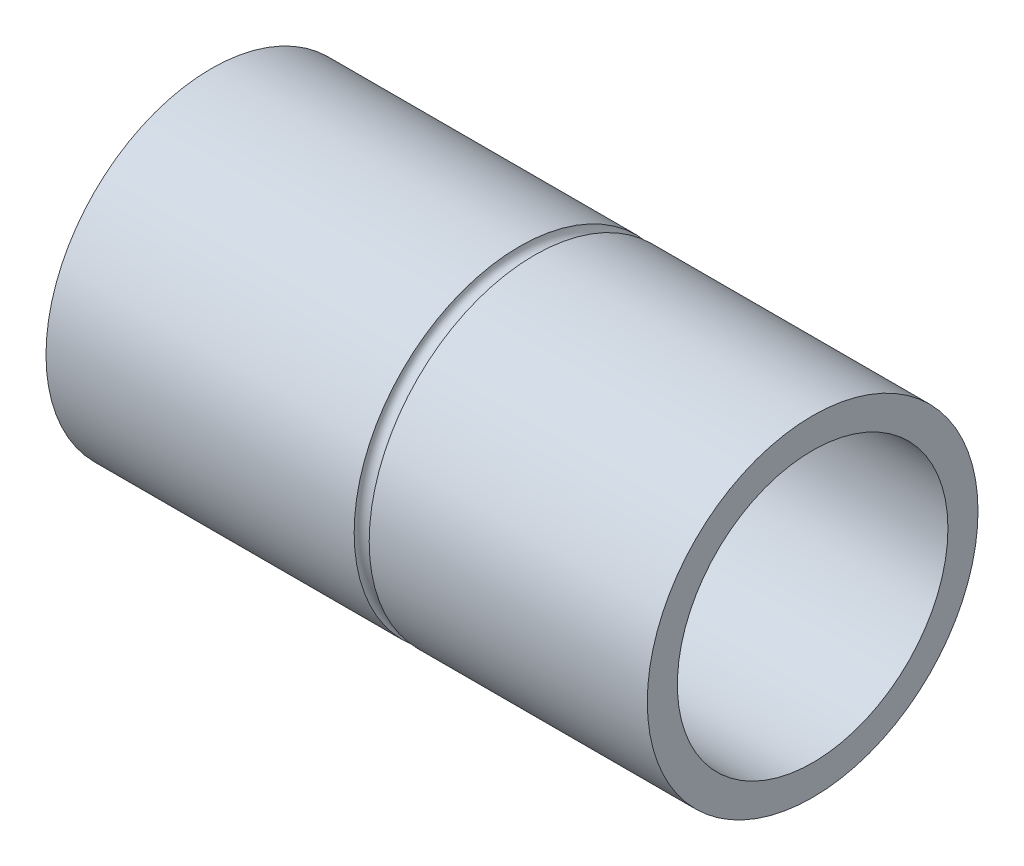
ISO-10303-21;
HEADER;
FILE_DESCRIPTION(('STEP AP214'),'2;1');
FILE_NAME('part.step','',(''),(''),'','','');
FILE_SCHEMA(('AUTOMOTIVE_DESIGN { 1 0 10303 214 1 1 1 1 }'));
ENDSEC;
DATA;
#1=APPLICATION_CONTEXT('core data for automotive mechanical design processes');
#2=APPLICATION_PROTOCOL_DEFINITION('international standard','automotive_design',2000,#1);
#3=PRODUCT_CONTEXT('',#1,'mechanical');
#4=PRODUCT('Part','Part','',(#3));
#5=PRODUCT_RELATED_PRODUCT_CATEGORY('part','',(#4));
#6=PRODUCT_DEFINITION_FORMATION('','',#4);
#7=PRODUCT_DEFINITION_CONTEXT('part definition',#1,'design');
#8=PRODUCT_DEFINITION('design','',#6,#7);
#9=PRODUCT_DEFINITION_SHAPE('','',#8);
#10=(LENGTH_UNIT() NAMED_UNIT(*) SI_UNIT(.MILLI.,.METRE.));
#11=(NAMED_UNIT(*) PLANE_ANGLE_UNIT() SI_UNIT($,.RADIAN.));
#12=(NAMED_UNIT(*) SI_UNIT($,.STERADIAN.) SOLID_ANGLE_UNIT());
#13=UNCERTAINTY_MEASURE_WITH_UNIT(LENGTH_MEASURE(1.E-05),#10,'distance_accuracy_value','');
#14=(GEOMETRIC_REPRESENTATION_CONTEXT(3) GLOBAL_UNCERTAINTY_ASSIGNED_CONTEXT((#13)) GLOBAL_UNIT_ASSIGNED_CONTEXT((#10,
#11,#12)) REPRESENTATION_CONTEXT('',''));
#15=CARTESIAN_POINT('',(0.,0.,0.));
#16=DIRECTION('',(0.,0.,1.));
#17=DIRECTION('',(1.,0.,0.));
#18=AXIS2_PLACEMENT_3D('',#15,#16,#17);
#19=CARTESIAN_POINT('',(200.,0.,0.));
#20=DIRECTION('',(-1.,0.,0.));
#21=DIRECTION('',(0.,0.,1.));
#22=AXIS2_PLACEMENT_3D('',#19,#20,#21);
#23=CYLINDRICAL_SURFACE('',#22,55.);
#24=CARTESIAN_POINT('',(107.5,0.,0.));
#25=DIRECTION('',(-1.,0.,0.));
#26=DIRECTION('',(0.,0.,1.));
#27=AXIS2_PLACEMENT_3D('',#24,#25,#26);
#28=CIRCLE('',#27,55.);
#29=CARTESIAN_POINT('',(107.5,0.,-55.));
#30=VERTEX_POINT('',#29);
#31=EDGE_CURVE('E12',#30,#30,#28,.F.);
#32=ORIENTED_EDGE('',*,*,#31,.T.);
#33=EDGE_LOOP('',(#32));
#34=FACE_BOUND('',#33,.T.);
#35=CARTESIAN_POINT('',(200.,0.,0.));
#36=DIRECTION('',(1.,0.,0.));
#37=DIRECTION('',(0.,0.,-1.));
#38=AXIS2_PLACEMENT_3D('',#35,#36,#37);
#39=CIRCLE('',#38,55.);
#40=CARTESIAN_POINT('',(200.,0.,-55.));
#41=VERTEX_POINT('',#40);
#42=EDGE_CURVE('E106',#41,#41,#39,.T.);
#43=ORIENTED_EDGE('',*,*,#42,.F.);
#44=EDGE_LOOP('',(#43));
#45=FACE_BOUND('',#44,.T.);
#46=ADVANCED_FACE('F52',(#34,#45),#23,.T.);
#47=CARTESIAN_POINT('',(200.,0.,0.));
#48=DIRECTION('',(-1.,0.,0.));
#49=DIRECTION('',(0.,0.,1.));
#50=AXIS2_PLACEMENT_3D('',#47,#48,#49);
#51=CYLINDRICAL_SURFACE('',#50,17.5);
#52=CARTESIAN_POINT('',(10.,0.,0.));
#53=DIRECTION('',(1.,0.,0.));
#54=DIRECTION('',(0.,0.,-1.));
#55=AXIS2_PLACEMENT_3D('',#52,#53,#54);
#56=CIRCLE('',#55,17.5);
#57=CARTESIAN_POINT('',(10.,0.,-17.5));
#58=VERTEX_POINT('',#57);
#59=EDGE_CURVE('E89',#58,#58,#56,.T.);
#60=ORIENTED_EDGE('',*,*,#59,.T.);
#61=EDGE_LOOP('',(#60));
#62=FACE_BOUND('',#61,.T.);
#63=CARTESIAN_POINT('',(2.,0.,0.));
#64=DIRECTION('',(-1.,0.,0.));
#65=DIRECTION('',(0.,0.,1.));
#66=AXIS2_PLACEMENT_3D('',#63,#64,#65);
#67=CIRCLE('',#66,17.5);
#68=CARTESIAN_POINT('',(2.,0.,17.5));
#69=VERTEX_POINT('',#68);
#70=EDGE_CURVE('E84',#69,#69,#67,.F.);
#71=ORIENTED_EDGE('',*,*,#70,.F.);
#72=EDGE_LOOP('',(#71));
#73=FACE_BOUND('',#72,.T.);
#74=ADVANCED_FACE('F118',(#62,#73),#51,.F.);
#75=CARTESIAN_POINT('',(102.5,0.,0.));
#76=DIRECTION('',(1.,0.,0.));
#77=DIRECTION('',(0.,0.,-1.));
#78=AXIS2_PLACEMENT_3D('',#75,#76,#77);
#79=CIRCLE('',#78,55.);
#80=CARTESIAN_POINT('',(102.5,0.,-55.));
#81=VERTEX_POINT('',#80);
#82=EDGE_CURVE('E60',#81,#81,#79,.F.);
#83=ORIENTED_EDGE('',*,*,#82,.T.);
#84=EDGE_LOOP('',(#83));
#85=FACE_BOUND('',#84,.T.);
#86=CARTESIAN_POINT('',(0.,0.,0.));
#87=DIRECTION('',(1.,0.,0.));
#88=DIRECTION('',(0.,0.,-1.));
#89=AXIS2_PLACEMENT_3D('',#86,#87,#88);
#90=CIRCLE('',#89,55.);
#91=CARTESIAN_POINT('',(0.,0.,-55.));
#92=VERTEX_POINT('',#91);
#93=EDGE_CURVE('E102',#92,#92,#90,.T.);
#94=ORIENTED_EDGE('',*,*,#93,.T.);
#95=EDGE_LOOP('',(#94));
#96=FACE_BOUND('',#95,.T.);
#97=ADVANCED_FACE('F54',(#85,#96),#23,.T.);
#98=CARTESIAN_POINT('',(200.,0.,0.));
#99=DIRECTION('',(1.,0.,0.));
#100=DIRECTION('',(0.,0.,-1.));
#101=AXIS2_PLACEMENT_3D('',#98,#99,#100);
#102=PLANE('',#101);
#103=CARTESIAN_POINT('',(200.,0.,0.));
#104=DIRECTION('',(1.,0.,0.));
#105=DIRECTION('',(0.,0.,-1.));
#106=AXIS2_PLACEMENT_3D('',#103,#104,#105);
#107=CIRCLE('',#106,45.);
#108=CARTESIAN_POINT('',(200.,0.,-45.));
#109=VERTEX_POINT('',#108);
#110=EDGE_CURVE('E103',#109,#109,#107,.T.);
#111=ORIENTED_EDGE('',*,*,#110,.F.);
#112=EDGE_LOOP('',(#111));
#113=FACE_BOUND('',#112,.T.);
#114=ORIENTED_EDGE('',*,*,#42,.T.);
#115=EDGE_LOOP('',(#114));
#116=FACE_BOUND('',#115,.T.);
#117=ADVANCED_FACE('F117',(#113,#116),#102,.T.);
#118=CARTESIAN_POINT('',(0.,0.,0.));
#119=DIRECTION('',(1.,0.,0.));
#120=DIRECTION('',(0.,0.,-1.));
#121=AXIS2_PLACEMENT_3D('',#118,#119,#120);
#122=PLANE('',#121);
#123=CARTESIAN_POINT('',(0.,0.,0.));
#124=DIRECTION('',(-1.,0.,0.));
#125=DIRECTION('',(0.,0.,1.));
#126=AXIS2_PLACEMENT_3D('',#123,#124,#125);
#127=CIRCLE('',#126,22.5);
#128=CARTESIAN_POINT('',(0.,0.,22.5));
#129=VERTEX_POINT('',#128);
#130=EDGE_CURVE('E70',#129,#129,#127,.T.);
#131=ORIENTED_EDGE('',*,*,#130,.F.);
#132=EDGE_LOOP('',(#131));
#133=FACE_BOUND('',#132,.T.);
#134=CARTESIAN_POINT('',(0.,34.,0.));
#135=DIRECTION('',(-1.,0.,0.));
#136=DIRECTION('',(0.,0.,1.));
#137=AXIS2_PLACEMENT_3D('',#134,#135,#136);
#138=CIRCLE('',#137,5.);
#139=CARTESIAN_POINT('',(0.,34.,5.));
#140=VERTEX_POINT('',#139);
#141=EDGE_CURVE('E90',#140,#140,#138,.T.);
#142=ORIENTED_EDGE('',*,*,#141,.F.);
#143=EDGE_LOOP('',(#142));
#144=FACE_BOUND('',#143,.T.);
#145=CARTESIAN_POINT('',(0.,-34.,0.));
#146=DIRECTION('',(-1.,0.,0.));
#147=DIRECTION('',(0.,0.,1.));
#148=AXIS2_PLACEMENT_3D('',#145,#146,#147);
#149=CIRCLE('',#148,5.);
#150=CARTESIAN_POINT('',(0.,-34.,5.));
#151=VERTEX_POINT('',#150);
#152=EDGE_CURVE('E96',#151,#151,#149,.T.);
#153=ORIENTED_EDGE('',*,*,#152,.F.);
#154=EDGE_LOOP('',(#153));
#155=FACE_BOUND('',#154,.T.);
#156=ORIENTED_EDGE('',*,*,#93,.F.);
#157=EDGE_LOOP('',(#156));
#158=FACE_BOUND('',#157,.T.);
#159=ADVANCED_FACE('F121',(#133,#144,#155,#158),#122,.F.);
#160=CARTESIAN_POINT('',(10.,0.,0.));
#161=DIRECTION('',(1.,0.,0.));
#162=DIRECTION('',(0.,0.,-1.));
#163=AXIS2_PLACEMENT_3D('',#160,#161,#162);
#164=CYLINDRICAL_SURFACE('',#163,45.);
#165=CARTESIAN_POINT('',(10.,0.,0.));
#166=DIRECTION('',(1.,0.,0.));
#167=DIRECTION('',(0.,0.,-1.));
#168=AXIS2_PLACEMENT_3D('',#165,#166,#167);
#169=CIRCLE('',#168,45.);
#170=CARTESIAN_POINT('',(10.,0.,-45.));
#171=VERTEX_POINT('',#170);
#172=EDGE_CURVE('E99',#171,#171,#169,.T.);
#173=ORIENTED_EDGE('',*,*,#172,.F.);
#174=EDGE_LOOP('',(#173));
#175=FACE_BOUND('',#174,.T.);
#176=ORIENTED_EDGE('',*,*,#110,.T.);
#177=EDGE_LOOP('',(#176));
#178=FACE_BOUND('',#177,.T.);
#179=ADVANCED_FACE('F123',(#175,#178),#164,.F.);
#180=CARTESIAN_POINT('',(10.,0.,0.));
#181=DIRECTION('',(1.,0.,0.));
#182=DIRECTION('',(0.,0.,-1.));
#183=AXIS2_PLACEMENT_3D('',#180,#181,#182);
#184=PLANE('',#183);
#185=ORIENTED_EDGE('',*,*,#59,.F.);
#186=EDGE_LOOP('',(#185));
#187=FACE_BOUND('',#186,.T.);
#188=ORIENTED_EDGE('',*,*,#172,.T.);
#189=EDGE_LOOP('',(#188));
#190=FACE_BOUND('',#189,.T.);
#191=ADVANCED_FACE('F129',(#187,#190),#184,.T.);
#192=CARTESIAN_POINT('',(2.,-34.,0.));
#193=DIRECTION('',(-1.,0.,0.));
#194=DIRECTION('',(0.,0.,1.));
#195=AXIS2_PLACEMENT_3D('',#192,#193,#194);
#196=CYLINDRICAL_SURFACE('',#195,5.);
#197=CARTESIAN_POINT('',(2.,-34.,0.));
#198=DIRECTION('',(-1.,0.,0.));
#199=DIRECTION('',(0.,0.,1.));
#200=AXIS2_PLACEMENT_3D('',#197,#198,#199);
#201=CIRCLE('',#200,5.);
#202=CARTESIAN_POINT('',(2.,-34.,5.));
#203=VERTEX_POINT('',#202);
#204=EDGE_CURVE('E93',#203,#203,#201,.T.);
#205=ORIENTED_EDGE('',*,*,#204,.F.);
#206=EDGE_LOOP('',(#205));
#207=FACE_BOUND('',#206,.T.);
#208=ORIENTED_EDGE('',*,*,#152,.T.);
#209=EDGE_LOOP('',(#208));
#210=FACE_BOUND('',#209,.T.);
#211=ADVANCED_FACE('F151',(#207,#210),#196,.F.);
#212=CARTESIAN_POINT('',(2.,-34.,0.));
#213=DIRECTION('',(-1.,0.,0.));
#214=DIRECTION('',(0.,0.,1.));
#215=AXIS2_PLACEMENT_3D('',#212,#213,#214);
#216=PLANE('',#215);
#217=CARTESIAN_POINT('',(2.,-34.,0.));
#218=DIRECTION('',(-1.,0.,0.));
#219=DIRECTION('',(0.,0.,1.));
#220=AXIS2_PLACEMENT_3D('',#217,#218,#219);
#221=CIRCLE('',#220,2.5);
#222=CARTESIAN_POINT('',(2.,-34.,2.5));
#223=VERTEX_POINT('',#222);
#224=EDGE_CURVE('E217',#223,#223,#221,.T.);
#225=ORIENTED_EDGE('',*,*,#224,.F.);
#226=EDGE_LOOP('',(#225));
#227=FACE_BOUND('',#226,.T.);
#228=ORIENTED_EDGE('',*,*,#204,.T.);
#229=EDGE_LOOP('',(#228));
#230=FACE_BOUND('',#229,.T.);
#231=ADVANCED_FACE('F158',(#227,#230),#216,.T.);
#232=CARTESIAN_POINT('',(2.,34.,0.));
#233=DIRECTION('',(-1.,0.,0.));
#234=DIRECTION('',(0.,0.,1.));
#235=AXIS2_PLACEMENT_3D('',#232,#233,#234);
#236=CYLINDRICAL_SURFACE('',#235,5.);
#237=CARTESIAN_POINT('',(2.,34.,0.));
#238=DIRECTION('',(-1.,0.,0.));
#239=DIRECTION('',(0.,0.,1.));
#240=AXIS2_PLACEMENT_3D('',#237,#238,#239);
#241=CIRCLE('',#240,5.);
#242=CARTESIAN_POINT('',(2.,34.,5.));
#243=VERTEX_POINT('',#242);
#244=EDGE_CURVE('E86',#243,#243,#241,.T.);
#245=ORIENTED_EDGE('',*,*,#244,.F.);
#246=EDGE_LOOP('',(#245));
#247=FACE_BOUND('',#246,.T.);
#248=ORIENTED_EDGE('',*,*,#141,.T.);
#249=EDGE_LOOP('',(#248));
#250=FACE_BOUND('',#249,.T.);
#251=ADVANCED_FACE('F168',(#247,#250),#236,.F.);
#252=CARTESIAN_POINT('',(2.,34.,0.));
#253=DIRECTION('',(-1.,0.,0.));
#254=DIRECTION('',(0.,0.,1.));
#255=AXIS2_PLACEMENT_3D('',#252,#253,#254);
#256=PLANE('',#255);
#257=CARTESIAN_POINT('',(2.,34.,0.));
#258=DIRECTION('',(-1.,0.,0.));
#259=DIRECTION('',(0.,0.,1.));
#260=AXIS2_PLACEMENT_3D('',#257,#258,#259);
#261=CIRCLE('',#260,2.5);
#262=CARTESIAN_POINT('',(2.,34.,2.5));
#263=VERTEX_POINT('',#262);
#264=EDGE_CURVE('E77',#263,#263,#261,.T.);
#265=ORIENTED_EDGE('',*,*,#264,.F.);
#266=EDGE_LOOP('',(#265));
#267=FACE_BOUND('',#266,.T.);
#268=ORIENTED_EDGE('',*,*,#244,.T.);
#269=EDGE_LOOP('',(#268));
#270=FACE_BOUND('',#269,.T.);
#271=ADVANCED_FACE('F178',(#267,#270),#256,.T.);
#272=CARTESIAN_POINT('',(2.,0.,0.));
#273=DIRECTION('',(-1.,0.,0.));
#274=DIRECTION('',(0.,0.,1.));
#275=AXIS2_PLACEMENT_3D('',#272,#273,#274);
#276=PLANE('',#275);
#277=CARTESIAN_POINT('',(2.,0.,0.));
#278=DIRECTION('',(-1.,0.,0.));
#279=DIRECTION('',(0.,0.,1.));
#280=AXIS2_PLACEMENT_3D('',#277,#278,#279);
#281=CIRCLE('',#280,22.5);
#282=CARTESIAN_POINT('',(2.,0.,22.5));
#283=VERTEX_POINT('',#282);
#284=EDGE_CURVE('E74',#283,#283,#281,.T.);
#285=ORIENTED_EDGE('',*,*,#284,.T.);
#286=EDGE_LOOP('',(#285));
#287=FACE_BOUND('',#286,.T.);
#288=ORIENTED_EDGE('',*,*,#70,.T.);
#289=EDGE_LOOP('',(#288));
#290=FACE_BOUND('',#289,.T.);
#291=ADVANCED_FACE('F185',(#287,#290),#276,.T.);
#292=CARTESIAN_POINT('',(2.,0.,0.));
#293=DIRECTION('',(-1.,0.,0.));
#294=DIRECTION('',(0.,0.,1.));
#295=AXIS2_PLACEMENT_3D('',#292,#293,#294);
#296=CYLINDRICAL_SURFACE('',#295,22.5);
#297=ORIENTED_EDGE('',*,*,#284,.F.);
#298=EDGE_LOOP('',(#297));
#299=FACE_BOUND('',#298,.T.);
#300=ORIENTED_EDGE('',*,*,#130,.T.);
#301=EDGE_LOOP('',(#300));
#302=FACE_BOUND('',#301,.T.);
#303=ADVANCED_FACE('F187',(#299,#302),#296,.F.);
#304=CARTESIAN_POINT('',(105.,0.,0.));
#305=DIRECTION('',(1.,0.,0.));
#306=DIRECTION('',(0.,0.,-1.));
#307=AXIS2_PLACEMENT_3D('',#304,#305,#306);
#308=TOROIDAL_SURFACE('',#307,55.,2.5);
#309=CARTESIAN_POINT('',(105.,0.,-55.));
#310=DIRECTION('',(0.,1.,0.));
#311=DIRECTION('',(-1.,0.,0.));
#312=AXIS2_PLACEMENT_3D('',#309,#310,#311);
#313=CIRCLE('',#312,2.5);
#314=EDGE_CURVE('E67',#81,#30,#313,.T.);
#315=ORIENTED_EDGE('',*,*,#314,.F.);
#316=ORIENTED_EDGE('',*,*,#82,.F.);
#317=ORIENTED_EDGE('',*,*,#314,.T.);
#318=ORIENTED_EDGE('',*,*,#31,.F.);
#319=EDGE_LOOP('',(#315,#316,#317,#318));
#320=FACE_BOUND('',#319,.T.);
#321=ADVANCED_FACE('F68',(#320),#308,.F.);
#322=CARTESIAN_POINT('',(4.,34.,0.));
#323=DIRECTION('',(-1.,0.,0.));
#324=DIRECTION('',(0.,0.,1.));
#325=AXIS2_PLACEMENT_3D('',#322,#323,#324);
#326=CYLINDRICAL_SURFACE('',#325,2.5);
#327=CARTESIAN_POINT('',(4.,34.,0.));
#328=DIRECTION('',(-1.,0.,0.));
#329=DIRECTION('',(0.,0.,1.));
#330=AXIS2_PLACEMENT_3D('',#327,#328,#329);
#331=CIRCLE('',#330,2.5);
#332=CARTESIAN_POINT('',(4.,34.,2.5));
#333=VERTEX_POINT('',#332);
#334=EDGE_CURVE('E71',#333,#333,#331,.T.);
#335=ORIENTED_EDGE('',*,*,#334,.F.);
#336=EDGE_LOOP('',(#335));
#337=FACE_BOUND('',#336,.T.);
#338=ORIENTED_EDGE('',*,*,#264,.T.);
#339=EDGE_LOOP('',(#338));
#340=FACE_BOUND('',#339,.T.);
#341=ADVANCED_FACE('F196',(#337,#340),#326,.F.);
#342=CARTESIAN_POINT('',(4.,34.,0.));
#343=DIRECTION('',(-1.,0.,0.));
#344=DIRECTION('',(0.,0.,1.));
#345=AXIS2_PLACEMENT_3D('',#342,#343,#344);
#346=PLANE('',#345);
#347=ORIENTED_EDGE('',*,*,#334,.T.);
#348=EDGE_LOOP('',(#347));
#349=FACE_BOUND('',#348,.T.);
#350=ADVANCED_FACE('F204',(#349),#346,.T.);
#351=CARTESIAN_POINT('',(4.,-34.,0.));
#352=DIRECTION('',(-1.,0.,0.));
#353=DIRECTION('',(0.,0.,1.));
#354=AXIS2_PLACEMENT_3D('',#351,#352,#353);
#355=CYLINDRICAL_SURFACE('',#354,2.5);
#356=CARTESIAN_POINT('',(4.,-34.,0.));
#357=DIRECTION('',(-1.,0.,0.));
#358=DIRECTION('',(0.,0.,1.));
#359=AXIS2_PLACEMENT_3D('',#356,#357,#358);
#360=CIRCLE('',#359,2.5);
#361=CARTESIAN_POINT('',(4.,-34.,2.5));
#362=VERTEX_POINT('',#361);
#363=EDGE_CURVE('E81',#362,#362,#360,.T.);
#364=ORIENTED_EDGE('',*,*,#363,.F.);
#365=EDGE_LOOP('',(#364));
#366=FACE_BOUND('',#365,.T.);
#367=ORIENTED_EDGE('',*,*,#224,.T.);
#368=EDGE_LOOP('',(#367));
#369=FACE_BOUND('',#368,.T.);
#370=ADVANCED_FACE('F200',(#366,#369),#355,.F.);
#371=CARTESIAN_POINT('',(4.,-34.,0.));
#372=DIRECTION('',(-1.,0.,0.));
#373=DIRECTION('',(0.,0.,1.));
#374=AXIS2_PLACEMENT_3D('',#371,#372,#373);
#375=PLANE('',#374);
#376=ORIENTED_EDGE('',*,*,#363,.T.);
#377=EDGE_LOOP('',(#376));
#378=FACE_BOUND('',#377,.T.);
#379=ADVANCED_FACE('F197',(#378),#375,.T.);
#380=CLOSED_SHELL('',(#46,#74,#97,#117,#159,#179,#191,#211,#231,#251,#271,#291,#303,#321,#341,
#350,#370,#379));
#381=MANIFOLD_SOLID_BREP('B2',#380);
#382=ADVANCED_BREP_SHAPE_REPRESENTATION('',(#18,#381),#14);
#383=SHAPE_DEFINITION_REPRESENTATION(#9,#382);
ENDSEC;
END-ISO-10303-21;
